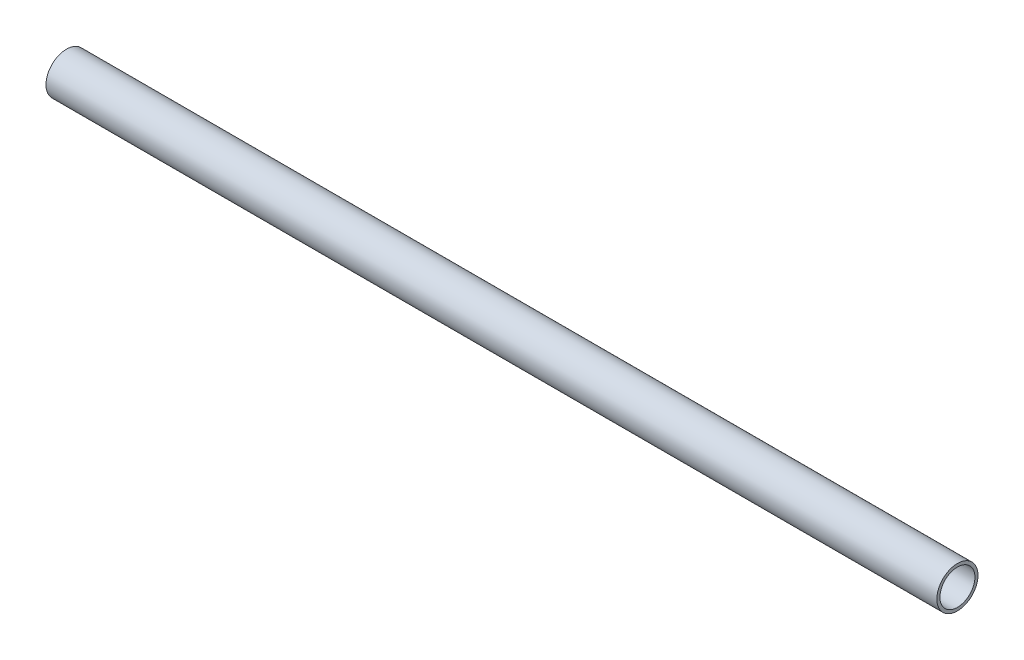
ISO-10303-21;
HEADER;
FILE_DESCRIPTION(('STEP AP214'),'2;1');
FILE_NAME('part.step','',(''),(''),'','','');
FILE_SCHEMA(('AUTOMOTIVE_DESIGN { 1 0 10303 214 1 1 1 1 }'));
ENDSEC;
DATA;
#1=APPLICATION_CONTEXT('core data for automotive mechanical design processes');
#2=APPLICATION_PROTOCOL_DEFINITION('international standard','automotive_design',2000,#1);
#3=PRODUCT_CONTEXT('',#1,'mechanical');
#4=PRODUCT('Part','Part','',(#3));
#5=PRODUCT_RELATED_PRODUCT_CATEGORY('part','',(#4));
#6=PRODUCT_DEFINITION_FORMATION('','',#4);
#7=PRODUCT_DEFINITION_CONTEXT('part definition',#1,'design');
#8=PRODUCT_DEFINITION('design','',#6,#7);
#9=PRODUCT_DEFINITION_SHAPE('','',#8);
#10=(LENGTH_UNIT() NAMED_UNIT(*) SI_UNIT(.MILLI.,.METRE.));
#11=(NAMED_UNIT(*) PLANE_ANGLE_UNIT() SI_UNIT($,.RADIAN.));
#12=(NAMED_UNIT(*) SI_UNIT($,.STERADIAN.) SOLID_ANGLE_UNIT());
#13=UNCERTAINTY_MEASURE_WITH_UNIT(LENGTH_MEASURE(1.E-05),#10,'distance_accuracy_value','');
#14=(GEOMETRIC_REPRESENTATION_CONTEXT(3) GLOBAL_UNCERTAINTY_ASSIGNED_CONTEXT((#13)) GLOBAL_UNIT_ASSIGNED_CONTEXT((#10,
#11,#12)) REPRESENTATION_CONTEXT('',''));
#15=CARTESIAN_POINT('',(0.,0.,0.));
#16=DIRECTION('',(0.,0.,1.));
#17=DIRECTION('',(1.,0.,0.));
#18=AXIS2_PLACEMENT_3D('',#15,#16,#17);
#19=CARTESIAN_POINT('',(550.,154.488190616094,5.16782733643684));
#20=DIRECTION('',(1.,0.,0.));
#21=DIRECTION('',(0.,0.,-1.));
#22=AXIS2_PLACEMENT_3D('',#19,#20,#21);
#23=PLANE('',#22);
#24=CARTESIAN_POINT('',(550.,154.488190616094,5.16782733643684));
#25=DIRECTION('',(1.,0.,0.));
#26=DIRECTION('',(0.,0.,-1.));
#27=AXIS2_PLACEMENT_3D('',#24,#25,#26);
#28=CIRCLE('',#27,12.7);
#29=CARTESIAN_POINT('',(550.,154.488190616094,-7.53217266356316));
#30=VERTEX_POINT('',#29);
#31=EDGE_CURVE('E12',#30,#30,#28,.T.);
#32=ORIENTED_EDGE('',*,*,#31,.T.);
#33=EDGE_LOOP('',(#32));
#34=FACE_BOUND('',#33,.T.);
#35=CARTESIAN_POINT('',(550.,154.488190616094,5.16782733643684));
#36=DIRECTION('',(1.,0.,0.));
#37=DIRECTION('',(0.,0.,-1.));
#38=AXIS2_PLACEMENT_3D('',#35,#36,#37);
#39=CIRCLE('',#38,10.795);
#40=CARTESIAN_POINT('',(550.,154.488190616094,-5.62717266356316));
#41=VERTEX_POINT('',#40);
#42=EDGE_CURVE('E53',#41,#41,#39,.T.);
#43=ORIENTED_EDGE('',*,*,#42,.F.);
#44=EDGE_LOOP('',(#43));
#45=FACE_BOUND('',#44,.T.);
#46=ADVANCED_FACE('F42',(#34,#45),#23,.T.);
#47=CARTESIAN_POINT('',(0.,154.488190616094,5.16782733643684));
#48=DIRECTION('',(1.,0.,0.));
#49=DIRECTION('',(0.,0.,-1.));
#50=AXIS2_PLACEMENT_3D('',#47,#48,#49);
#51=PLANE('',#50);
#52=CARTESIAN_POINT('',(0.,154.488190616094,5.16782733643684));
#53=DIRECTION('',(1.,0.,0.));
#54=DIRECTION('',(0.,0.,-1.));
#55=AXIS2_PLACEMENT_3D('',#52,#53,#54);
#56=CIRCLE('',#55,12.7);
#57=CARTESIAN_POINT('',(0.,154.488190616094,-7.53217266356316));
#58=VERTEX_POINT('',#57);
#59=EDGE_CURVE('E46',#58,#58,#56,.T.);
#60=ORIENTED_EDGE('',*,*,#59,.F.);
#61=EDGE_LOOP('',(#60));
#62=FACE_BOUND('',#61,.T.);
#63=CARTESIAN_POINT('',(0.,154.488190616094,5.16782733643684));
#64=DIRECTION('',(1.,0.,0.));
#65=DIRECTION('',(0.,0.,-1.));
#66=AXIS2_PLACEMENT_3D('',#63,#64,#65);
#67=CIRCLE('',#66,10.795);
#68=CARTESIAN_POINT('',(0.,154.488190616094,-5.62717266356316));
#69=VERTEX_POINT('',#68);
#70=EDGE_CURVE('E55',#69,#69,#67,.T.);
#71=ORIENTED_EDGE('',*,*,#70,.T.);
#72=EDGE_LOOP('',(#71));
#73=FACE_BOUND('',#72,.T.);
#74=ADVANCED_FACE('F65',(#62,#73),#51,.F.);
#75=CARTESIAN_POINT('',(550.,154.488190616094,5.16782733643684));
#76=DIRECTION('',(-1.,0.,0.));
#77=DIRECTION('',(0.,0.,1.));
#78=AXIS2_PLACEMENT_3D('',#75,#76,#77);
#79=CYLINDRICAL_SURFACE('',#78,12.7);
#80=ORIENTED_EDGE('',*,*,#31,.F.);
#81=EDGE_LOOP('',(#80));
#82=FACE_BOUND('',#81,.T.);
#83=ORIENTED_EDGE('',*,*,#59,.T.);
#84=EDGE_LOOP('',(#83));
#85=FACE_BOUND('',#84,.T.);
#86=ADVANCED_FACE('F44',(#82,#85),#79,.T.);
#87=CARTESIAN_POINT('',(550.,154.488190616094,5.16782733643684));
#88=DIRECTION('',(-1.,0.,0.));
#89=DIRECTION('',(0.,0.,1.));
#90=AXIS2_PLACEMENT_3D('',#87,#88,#89);
#91=CYLINDRICAL_SURFACE('',#90,10.795);
#92=ORIENTED_EDGE('',*,*,#42,.T.);
#93=EDGE_LOOP('',(#92));
#94=FACE_BOUND('',#93,.T.);
#95=ORIENTED_EDGE('',*,*,#70,.F.);
#96=EDGE_LOOP('',(#95));
#97=FACE_BOUND('',#96,.T.);
#98=ADVANCED_FACE('F61',(#94,#97),#91,.F.);
#99=CLOSED_SHELL('',(#46,#74,#86,#98));
#100=MANIFOLD_SOLID_BREP('B2',#99);
#101=ADVANCED_BREP_SHAPE_REPRESENTATION('',(#18,#100),#14);
#102=SHAPE_DEFINITION_REPRESENTATION(#9,#101);
ENDSEC;
END-ISO-10303-21;
